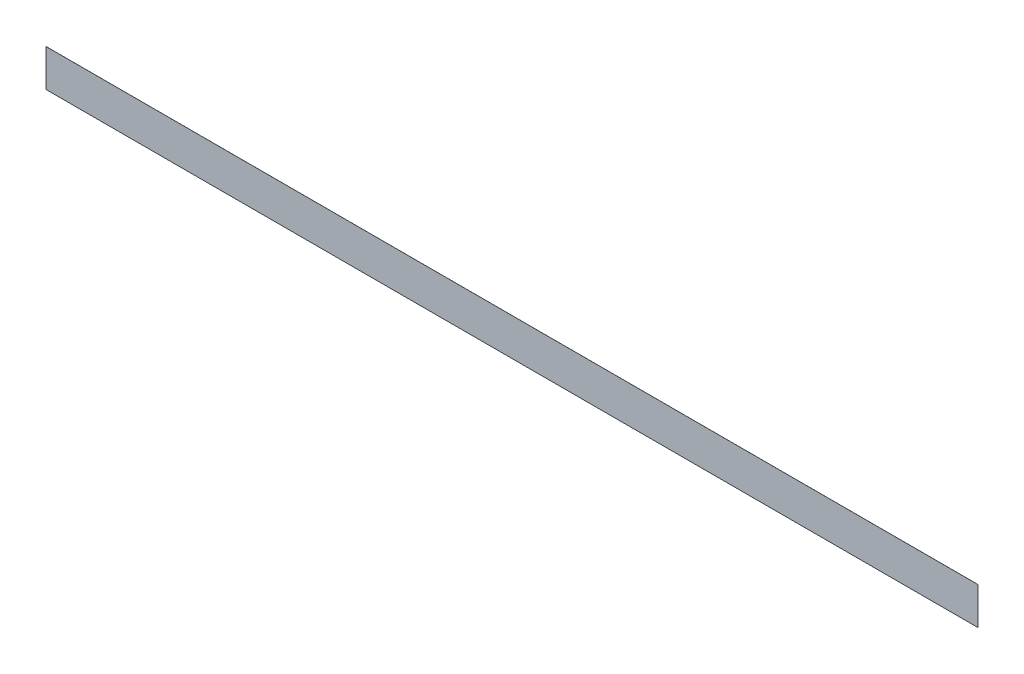
ISO-10303-21;
HEADER;
FILE_DESCRIPTION(('STEP AP214'),'2;1');
FILE_NAME('part.step','',(''),(''),'','','');
FILE_SCHEMA(('AUTOMOTIVE_DESIGN { 1 0 10303 214 1 1 1 1 }'));
ENDSEC;
DATA;
#1=APPLICATION_CONTEXT('core data for automotive mechanical design processes');
#2=APPLICATION_PROTOCOL_DEFINITION('international standard','automotive_design',2000,#1);
#3=PRODUCT_CONTEXT('',#1,'mechanical');
#4=PRODUCT('Part','Part','',(#3));
#5=PRODUCT_RELATED_PRODUCT_CATEGORY('part','',(#4));
#6=PRODUCT_DEFINITION_FORMATION('','',#4);
#7=PRODUCT_DEFINITION_CONTEXT('part definition',#1,'design');
#8=PRODUCT_DEFINITION('design','',#6,#7);
#9=PRODUCT_DEFINITION_SHAPE('','',#8);
#10=(LENGTH_UNIT() NAMED_UNIT(*) SI_UNIT(.MILLI.,.METRE.));
#11=(NAMED_UNIT(*) PLANE_ANGLE_UNIT() SI_UNIT($,.RADIAN.));
#12=(NAMED_UNIT(*) SI_UNIT($,.STERADIAN.) SOLID_ANGLE_UNIT());
#13=UNCERTAINTY_MEASURE_WITH_UNIT(LENGTH_MEASURE(1.E-05),#10,'distance_accuracy_value','');
#14=(GEOMETRIC_REPRESENTATION_CONTEXT(3) GLOBAL_UNCERTAINTY_ASSIGNED_CONTEXT((#13)) GLOBAL_UNIT_ASSIGNED_CONTEXT((#10,
#11,#12)) REPRESENTATION_CONTEXT('',''));
#15=CARTESIAN_POINT('',(0.,0.,0.));
#16=DIRECTION('',(0.,0.,1.));
#17=DIRECTION('',(1.,0.,0.));
#18=AXIS2_PLACEMENT_3D('',#15,#16,#17);
#19=CARTESIAN_POINT('',(-125000.,-5000.,10.));
#20=DIRECTION('',(0.,1.,0.));
#21=DIRECTION('',(0.,0.,1.));
#22=AXIS2_PLACEMENT_3D('',#19,#20,#21);
#23=PLANE('',#22);
#24=DIRECTION('',(1.,0.,0.));
#25=VECTOR('',#24,1.);
#26=CARTESIAN_POINT('',(-125000.,-5000.,0.));
#27=LINE('',#26,#25);
#28=CARTESIAN_POINT('',(-125000.,-5000.,0.));
#29=VERTEX_POINT('',#28);
#30=CARTESIAN_POINT('',(125000.,-5000.,0.));
#31=VERTEX_POINT('',#30);
#32=EDGE_CURVE('E95',#29,#31,#27,.T.);
#33=ORIENTED_EDGE('',*,*,#32,.T.);
#34=DIRECTION('',(0.,0.,-1.));
#35=VECTOR('',#34,1.);
#36=CARTESIAN_POINT('',(125000.,-5000.,10.));
#37=LINE('',#36,#35);
#38=CARTESIAN_POINT('',(125000.,-5000.,10.));
#39=VERTEX_POINT('',#38);
#40=EDGE_CURVE('E11',#39,#31,#37,.T.);
#41=ORIENTED_EDGE('',*,*,#40,.F.);
#42=DIRECTION('',(1.,0.,0.));
#43=VECTOR('',#42,1.);
#44=CARTESIAN_POINT('',(-125000.,-5000.,10.));
#45=LINE('',#44,#43);
#46=CARTESIAN_POINT('',(-125000.,-5000.,10.));
#47=VERTEX_POINT('',#46);
#48=EDGE_CURVE('E72',#47,#39,#45,.T.);
#49=ORIENTED_EDGE('',*,*,#48,.F.);
#50=DIRECTION('',(0.,0.,-1.));
#51=VECTOR('',#50,1.);
#52=CARTESIAN_POINT('',(-125000.,-5000.,10.));
#53=LINE('',#52,#51);
#54=EDGE_CURVE('E91',#47,#29,#53,.T.);
#55=ORIENTED_EDGE('',*,*,#54,.T.);
#56=EDGE_LOOP('',(#33,#41,#49,#55));
#57=FACE_BOUND('',#56,.T.);
#58=ADVANCED_FACE('F33',(#57),#23,.F.);
#59=CARTESIAN_POINT('',(125000.,5000.,10.));
#60=DIRECTION('',(1.,0.,0.));
#61=DIRECTION('',(0.,1.,0.));
#62=AXIS2_PLACEMENT_3D('',#59,#60,#61);
#63=PLANE('',#62);
#64=DIRECTION('',(0.,-1.,0.));
#65=VECTOR('',#64,1.);
#66=CARTESIAN_POINT('',(125000.,5000.,0.));
#67=LINE('',#66,#65);
#68=CARTESIAN_POINT('',(125000.,5000.,0.));
#69=VERTEX_POINT('',#68);
#70=EDGE_CURVE('E81',#69,#31,#67,.T.);
#71=ORIENTED_EDGE('',*,*,#70,.F.);
#72=DIRECTION('',(0.,0.,-1.));
#73=VECTOR('',#72,1.);
#74=CARTESIAN_POINT('',(125000.,5000.,10.));
#75=LINE('',#74,#73);
#76=CARTESIAN_POINT('',(125000.,5000.,10.));
#77=VERTEX_POINT('',#76);
#78=EDGE_CURVE('E41',#77,#69,#75,.T.);
#79=ORIENTED_EDGE('',*,*,#78,.F.);
#80=DIRECTION('',(0.,-1.,0.));
#81=VECTOR('',#80,1.);
#82=CARTESIAN_POINT('',(125000.,5000.,10.));
#83=LINE('',#82,#81);
#84=EDGE_CURVE('E79',#77,#39,#83,.T.);
#85=ORIENTED_EDGE('',*,*,#84,.T.);
#86=ORIENTED_EDGE('',*,*,#40,.T.);
#87=EDGE_LOOP('',(#71,#79,#85,#86));
#88=FACE_BOUND('',#87,.T.);
#89=ADVANCED_FACE('F78',(#88),#63,.T.);
#90=CARTESIAN_POINT('',(-125000.,5000.,10.));
#91=DIRECTION('',(0.,1.,0.));
#92=DIRECTION('',(0.,0.,1.));
#93=AXIS2_PLACEMENT_3D('',#90,#91,#92);
#94=PLANE('',#93);
#95=DIRECTION('',(1.,0.,0.));
#96=VECTOR('',#95,1.);
#97=CARTESIAN_POINT('',(-125000.,5000.,0.));
#98=LINE('',#97,#96);
#99=CARTESIAN_POINT('',(-125000.,5000.,0.));
#100=VERTEX_POINT('',#99);
#101=EDGE_CURVE('E99',#100,#69,#98,.T.);
#102=ORIENTED_EDGE('',*,*,#101,.F.);
#103=DIRECTION('',(0.,0.,-1.));
#104=VECTOR('',#103,1.);
#105=CARTESIAN_POINT('',(-125000.,5000.,10.));
#106=LINE('',#105,#104);
#107=CARTESIAN_POINT('',(-125000.,5000.,10.));
#108=VERTEX_POINT('',#107);
#109=EDGE_CURVE('E64',#108,#100,#106,.T.);
#110=ORIENTED_EDGE('',*,*,#109,.F.);
#111=DIRECTION('',(1.,0.,0.));
#112=VECTOR('',#111,1.);
#113=CARTESIAN_POINT('',(-125000.,5000.,10.));
#114=LINE('',#113,#112);
#115=EDGE_CURVE('E87',#108,#77,#114,.T.);
#116=ORIENTED_EDGE('',*,*,#115,.T.);
#117=ORIENTED_EDGE('',*,*,#78,.T.);
#118=EDGE_LOOP('',(#102,#110,#116,#117));
#119=FACE_BOUND('',#118,.T.);
#120=ADVANCED_FACE('F89',(#119),#94,.T.);
#121=CARTESIAN_POINT('',(-125000.,5000.,10.));
#122=DIRECTION('',(1.,0.,0.));
#123=DIRECTION('',(0.,0.,-1.));
#124=AXIS2_PLACEMENT_3D('',#121,#122,#123);
#125=PLANE('',#124);
#126=DIRECTION('',(0.,-1.,0.));
#127=VECTOR('',#126,1.);
#128=CARTESIAN_POINT('',(-125000.,5000.,0.));
#129=LINE('',#128,#127);
#130=EDGE_CURVE('E67',#100,#29,#129,.T.);
#131=ORIENTED_EDGE('',*,*,#130,.T.);
#132=ORIENTED_EDGE('',*,*,#54,.F.);
#133=DIRECTION('',(0.,-1.,0.));
#134=VECTOR('',#133,1.);
#135=CARTESIAN_POINT('',(-125000.,5000.,10.));
#136=LINE('',#135,#134);
#137=EDGE_CURVE('E49',#108,#47,#136,.T.);
#138=ORIENTED_EDGE('',*,*,#137,.F.);
#139=ORIENTED_EDGE('',*,*,#109,.T.);
#140=EDGE_LOOP('',(#131,#132,#138,#139));
#141=FACE_BOUND('',#140,.T.);
#142=ADVANCED_FACE('F112',(#141),#125,.F.);
#143=CARTESIAN_POINT('',(0.,0.,10.));
#144=DIRECTION('',(0.,0.,-1.));
#145=DIRECTION('',(-1.,0.,0.));
#146=AXIS2_PLACEMENT_3D('',#143,#144,#145);
#147=PLANE('',#146);
#148=ORIENTED_EDGE('',*,*,#48,.T.);
#149=ORIENTED_EDGE('',*,*,#84,.F.);
#150=ORIENTED_EDGE('',*,*,#115,.F.);
#151=ORIENTED_EDGE('',*,*,#137,.T.);
#152=EDGE_LOOP('',(#148,#149,#150,#151));
#153=FACE_BOUND('',#152,.T.);
#154=ADVANCED_FACE('F86',(#153),#147,.F.);
#155=CARTESIAN_POINT('',(0.,0.,0.));
#156=DIRECTION('',(0.,0.,-1.));
#157=DIRECTION('',(-1.,0.,0.));
#158=AXIS2_PLACEMENT_3D('',#155,#156,#157);
#159=PLANE('',#158);
#160=ORIENTED_EDGE('',*,*,#32,.F.);
#161=ORIENTED_EDGE('',*,*,#130,.F.);
#162=ORIENTED_EDGE('',*,*,#101,.T.);
#163=ORIENTED_EDGE('',*,*,#70,.T.);
#164=EDGE_LOOP('',(#160,#161,#162,#163));
#165=FACE_BOUND('',#164,.T.);
#166=ADVANCED_FACE('F106',(#165),#159,.T.);
#167=CLOSED_SHELL('',(#58,#89,#120,#142,#154,#166));
#168=MANIFOLD_SOLID_BREP('B2',#167);
#169=ADVANCED_BREP_SHAPE_REPRESENTATION('',(#18,#168),#14);
#170=SHAPE_DEFINITION_REPRESENTATION(#9,#169);
ENDSEC;
END-ISO-10303-21;
